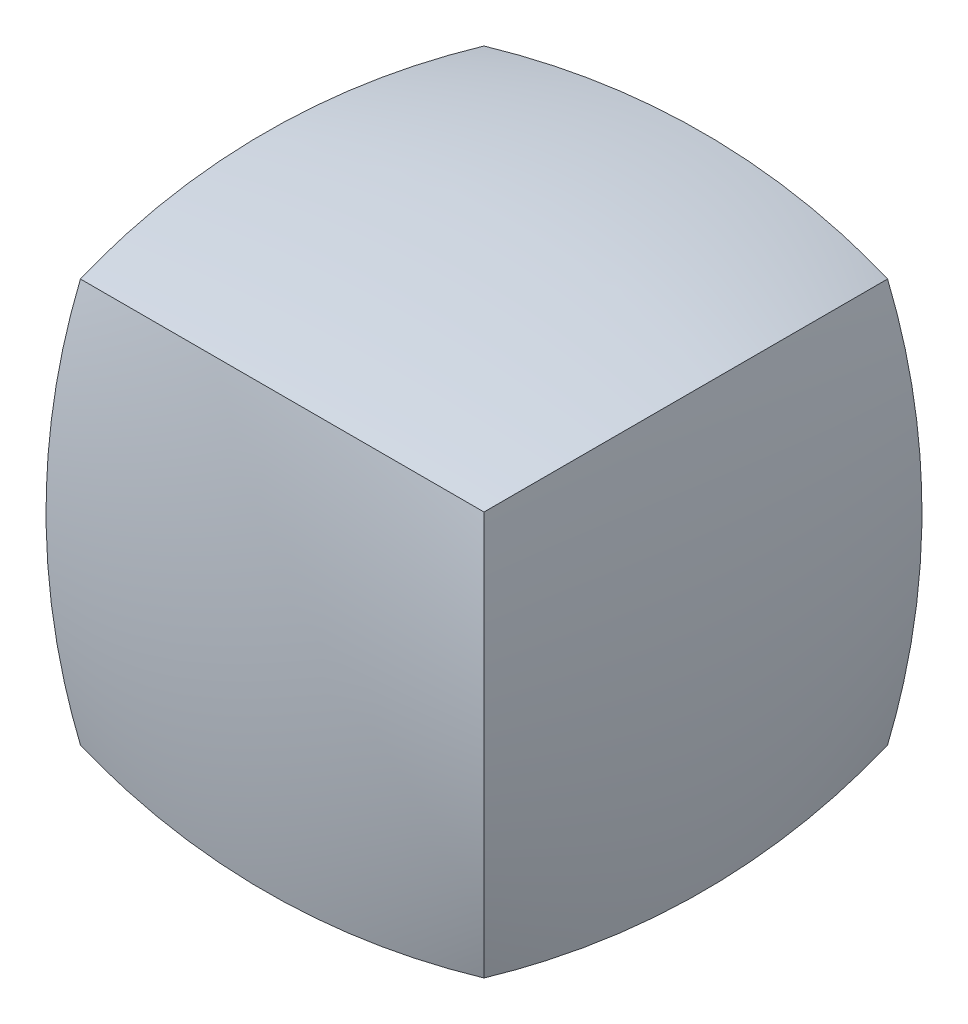
ISO-10303-21;
HEADER;
FILE_DESCRIPTION(('STEP AP214'),'2;1');
FILE_NAME('part.step','',(''),(''),'','','');
FILE_SCHEMA(('AUTOMOTIVE_DESIGN { 1 0 10303 214 1 1 1 1 }'));
ENDSEC;
DATA;
#1=APPLICATION_CONTEXT('core data for automotive mechanical design processes');
#2=APPLICATION_PROTOCOL_DEFINITION('international standard','automotive_design',2000,#1);
#3=PRODUCT_CONTEXT('',#1,'mechanical');
#4=PRODUCT('Part','Part','',(#3));
#5=PRODUCT_RELATED_PRODUCT_CATEGORY('part','',(#4));
#6=PRODUCT_DEFINITION_FORMATION('','',#4);
#7=PRODUCT_DEFINITION_CONTEXT('part definition',#1,'design');
#8=PRODUCT_DEFINITION('design','',#6,#7);
#9=PRODUCT_DEFINITION_SHAPE('','',#8);
#10=(LENGTH_UNIT() NAMED_UNIT(*) SI_UNIT(.MILLI.,.METRE.));
#11=(NAMED_UNIT(*) PLANE_ANGLE_UNIT() SI_UNIT($,.RADIAN.));
#12=(NAMED_UNIT(*) SI_UNIT($,.STERADIAN.) SOLID_ANGLE_UNIT());
#13=UNCERTAINTY_MEASURE_WITH_UNIT(LENGTH_MEASURE(1.E-05),#10,'distance_accuracy_value','');
#14=(GEOMETRIC_REPRESENTATION_CONTEXT(3) GLOBAL_UNCERTAINTY_ASSIGNED_CONTEXT((#13)) GLOBAL_UNIT_ASSIGNED_CONTEXT((#10,
#11,#12)) REPRESENTATION_CONTEXT('',''));
#15=CARTESIAN_POINT('',(0.,0.,0.));
#16=DIRECTION('',(0.,0.,1.));
#17=DIRECTION('',(1.,0.,0.));
#18=AXIS2_PLACEMENT_3D('',#15,#16,#17);
#19=CARTESIAN_POINT('',(-12.6999999999999,-12.6999999999999,-12.7000000000001));
#20=CARTESIAN_POINT('',(-4.29501009499707,-14.1440994317725,-14.1440994317726));
#21=CARTESIAN_POINT('',(4.2950100949973,-14.1440994317725,-14.1440994317725));
#22=CARTESIAN_POINT('',(12.7000000000001,-12.7,-12.7));
#23=CARTESIAN_POINT('',(-14.1440994317725,-14.1440994317725,-4.29501009499725));
#24=CARTESIAN_POINT('',(-4.77637657225462,-15.588198863545,-4.77637657225471));
#25=CARTESIAN_POINT('',(4.77637657225472,-15.5881988635449,-4.77637657225467));
#26=CARTESIAN_POINT('',(14.1440994317726,-14.1440994317725,-4.29501009499718));
#27=CARTESIAN_POINT('',(-14.1440994317725,-14.1440994317725,4.29501009499709));
#28=CARTESIAN_POINT('',(-4.77637657225466,-15.588198863545,4.77637657225468));
#29=CARTESIAN_POINT('',(4.77637657225466,-15.5881988635449,4.77637657225468));
#30=CARTESIAN_POINT('',(14.1440994317726,-14.1440994317726,4.29501009499718));
#31=CARTESIAN_POINT('',(-12.7000000000001,-12.7000000000001,12.6999999999999));
#32=CARTESIAN_POINT('',(-4.29501009499723,-14.1440994317725,14.1440994317726));
#33=CARTESIAN_POINT('',(4.2950100949971,-14.1440994317725,14.1440994317725));
#34=CARTESIAN_POINT('',(12.7000000000002,-12.7000000000002,12.7));
#35=B_SPLINE_SURFACE_WITH_KNOTS('',3,3,((#19,#20,#21,#22),(#23,#24,#25,#26),(#27,#28,#29,#30),
(#31,#32,#33,#34)),.UNSPECIFIED.,.F.,.F.,.F.,(4,4),(4,4),(0.,1.),(0.,1.),.UNSPECIFIED.);
#36=CARTESIAN_POINT('',(-12.7,-12.7000000000001,12.7));
#37=CARTESIAN_POINT('',(-14.1440994317725,-14.1440994317725,4.29501009499724));
#38=CARTESIAN_POINT('',(-14.1440994317726,-14.1440994317725,-4.29501009499709));
#39=CARTESIAN_POINT('',(-12.7000000000002,-12.7,-12.6999999999999));
#40=B_SPLINE_CURVE_WITH_KNOTS('',3,(#36,#37,#38,#39),.UNSPECIFIED.,.F.,.F.,(4,4),(0.,1.),.UNSPECIFIED.);
#41=CARTESIAN_POINT('',(-12.7,-12.7,-12.7));
#42=VERTEX_POINT('',#41);
#43=CARTESIAN_POINT('',(-12.7,-12.7000000000001,12.7));
#44=VERTEX_POINT('',#43);
#45=EDGE_CURVE('E114',#42,#44,#40,.F.);
#46=CARTESIAN_POINT('',(-12.7,-12.7000000000001,-12.7));
#47=CARTESIAN_POINT('',(-4.29501009499719,-14.1440994317725,-14.1440994317725));
#48=CARTESIAN_POINT('',(4.29501009499714,-14.1440994317725,-14.1440994317725));
#49=CARTESIAN_POINT('',(12.6999999999999,-12.7,-12.7000000000001));
#50=B_SPLINE_CURVE_WITH_KNOTS('',3,(#46,#47,#48,#49),.UNSPECIFIED.,.F.,.F.,(4,4),(0.,1.),.UNSPECIFIED.);
#51=CARTESIAN_POINT('',(12.7,-12.7000000000001,-12.7000000000001));
#52=VERTEX_POINT('',#51);
#53=EDGE_CURVE('E73',#52,#42,#50,.F.);
#54=CARTESIAN_POINT('',(12.7000000000001,-12.7000000000001,-12.6999999999999));
#55=CARTESIAN_POINT('',(14.1440994317725,-14.1440994317725,-4.29501009499714));
#56=CARTESIAN_POINT('',(14.1440994317725,-14.1440994317725,4.29501009499718));
#57=CARTESIAN_POINT('',(12.7000000000001,-12.7,12.7));
#58=B_SPLINE_CURVE_WITH_KNOTS('',3,(#54,#55,#56,#57),.UNSPECIFIED.,.F.,.F.,(4,4),(0.,1.),.UNSPECIFIED.);
#59=CARTESIAN_POINT('',(12.7000000000001,-12.7000000000001,12.7));
#60=VERTEX_POINT('',#59);
#61=EDGE_CURVE('E110',#60,#52,#58,.F.);
#62=CARTESIAN_POINT('',(12.6999999999999,-12.7000000000001,12.7000000000001));
#63=CARTESIAN_POINT('',(4.29501009499709,-14.1440994317725,14.1440994317725));
#64=CARTESIAN_POINT('',(-4.29501009499723,-14.1440994317725,14.1440994317725));
#65=CARTESIAN_POINT('',(-12.7,-12.7,12.7000000000001));
#66=B_SPLINE_CURVE_WITH_KNOTS('',3,(#62,#63,#64,#65),.UNSPECIFIED.,.F.,.F.,(4,4),(0.,1.),.UNSPECIFIED.);
#67=EDGE_CURVE('E132',#44,#60,#66,.F.);
#68=ORIENTED_EDGE('',*,*,#45,.F.);
#69=ORIENTED_EDGE('',*,*,#53,.F.);
#70=ORIENTED_EDGE('',*,*,#61,.F.);
#71=ORIENTED_EDGE('',*,*,#67,.F.);
#72=EDGE_LOOP('',(#68,#69,#70,#71));
#73=FACE_BOUND('',#72,.T.);
#74=ADVANCED_FACE('F68',(#73),#35,.F.);
#75=CARTESIAN_POINT('',(-12.7,12.7,-12.6999999999999));
#76=CARTESIAN_POINT('',(-14.1440994317724,4.29501009499727,-14.1440994317724));
#77=CARTESIAN_POINT('',(-14.1440994317725,-4.29501009499709,-14.1440994317724));
#78=CARTESIAN_POINT('',(-12.7,-12.7000000000001,-12.7));
#79=CARTESIAN_POINT('',(-4.2950100949972,14.1440994317725,-14.1440994317725));
#80=CARTESIAN_POINT('',(-4.77637657225469,4.77637657225475,-15.5881988635449));
#81=CARTESIAN_POINT('',(-4.7763765722547,-4.77637657225456,-15.5881988635449));
#82=CARTESIAN_POINT('',(-4.29501009499719,-14.1440994317725,-14.1440994317725));
#83=CARTESIAN_POINT('',(4.29501009499713,14.1440994317725,-14.1440994317726));
#84=CARTESIAN_POINT('',(4.7763765722546,4.77637657225476,-15.5881988635449));
#85=CARTESIAN_POINT('',(4.77637657225462,-4.77637657225454,-15.5881988635449));
#86=CARTESIAN_POINT('',(4.29501009499714,-14.1440994317725,-14.1440994317725));
#87=CARTESIAN_POINT('',(12.6999999999999,12.7000000000001,-12.7000000000002));
#88=CARTESIAN_POINT('',(14.1440994317724,4.29501009499727,-14.1440994317724));
#89=CARTESIAN_POINT('',(14.1440994317724,-4.29501009499706,-14.1440994317725));
#90=CARTESIAN_POINT('',(12.6999999999999,-12.7,-12.7000000000001));
#91=B_SPLINE_SURFACE_WITH_KNOTS('',3,3,((#75,#76,#77,#78),(#79,#80,#81,#82),(#83,#84,#85,#86),
(#87,#88,#89,#90)),.UNSPECIFIED.,.F.,.F.,.F.,(4,4),(4,4),(0.,1.),(0.,1.),.UNSPECIFIED.);
#92=CARTESIAN_POINT('',(-12.6999999999999,12.6999999999999,-12.7000000000001));
#93=CARTESIAN_POINT('',(-4.29501009499707,14.1440994317725,-14.1440994317726));
#94=CARTESIAN_POINT('',(4.2950100949973,14.1440994317725,-14.1440994317725));
#95=CARTESIAN_POINT('',(12.7000000000001,12.7,-12.7));
#96=B_SPLINE_CURVE_WITH_KNOTS('',3,(#92,#93,#94,#95),.UNSPECIFIED.,.F.,.F.,(4,4),(0.,1.),.UNSPECIFIED.);
#97=CARTESIAN_POINT('',(12.7,12.7000000000001,-12.7000000000001));
#98=VERTEX_POINT('',#97);
#99=CARTESIAN_POINT('',(-12.7,12.7,-12.7));
#100=VERTEX_POINT('',#99);
#101=EDGE_CURVE('E91',#98,#100,#96,.F.);
#102=CARTESIAN_POINT('',(12.7,12.7,-12.7));
#103=CARTESIAN_POINT('',(14.1440994317725,4.29501009499727,-14.1440994317724));
#104=CARTESIAN_POINT('',(14.1440994317725,-4.29501009499709,-14.1440994317724));
#105=CARTESIAN_POINT('',(12.7000000000001,-12.7000000000001,-12.6999999999999));
#106=B_SPLINE_CURVE_WITH_KNOTS('',3,(#102,#103,#104,#105),.UNSPECIFIED.,.F.,.F.,(4,4),(0.,1.),.UNSPECIFIED.);
#107=EDGE_CURVE('E117',#52,#98,#106,.F.);
#108=CARTESIAN_POINT('',(-12.7000000000003,12.7000000000001,-12.6999999999999));
#109=CARTESIAN_POINT('',(-14.1440994317725,4.29501009499727,-14.1440994317723));
#110=CARTESIAN_POINT('',(-14.1440994317726,-4.29501009499706,-14.1440994317724));
#111=CARTESIAN_POINT('',(-12.7000000000002,-12.7,-12.6999999999999));
#112=B_SPLINE_CURVE_WITH_KNOTS('',3,(#108,#109,#110,#111),.UNSPECIFIED.,.F.,.F.,(4,4),(0.,1.),.UNSPECIFIED.);
#113=EDGE_CURVE('E170',#100,#42,#112,.T.);
#114=ORIENTED_EDGE('',*,*,#101,.F.);
#115=ORIENTED_EDGE('',*,*,#107,.F.);
#116=ORIENTED_EDGE('',*,*,#53,.T.);
#117=ORIENTED_EDGE('',*,*,#113,.F.);
#118=EDGE_LOOP('',(#114,#115,#116,#117));
#119=FACE_BOUND('',#118,.T.);
#120=ADVANCED_FACE('F118',(#119),#91,.T.);
#121=CARTESIAN_POINT('',(12.7,12.7,-12.7));
#122=CARTESIAN_POINT('',(14.1440994317725,4.29501009499727,-14.1440994317724));
#123=CARTESIAN_POINT('',(14.1440994317725,-4.29501009499709,-14.1440994317724));
#124=CARTESIAN_POINT('',(12.7000000000001,-12.7000000000001,-12.6999999999999));
#125=CARTESIAN_POINT('',(14.1440994317725,14.1440994317725,-4.29501009499715));
#126=CARTESIAN_POINT('',(15.5881988635449,4.77637657225475,-4.77637657225464));
#127=CARTESIAN_POINT('',(15.5881988635449,-4.77637657225456,-4.77637657225464));
#128=CARTESIAN_POINT('',(14.1440994317725,-14.1440994317725,-4.29501009499714));
#129=CARTESIAN_POINT('',(14.1440994317726,14.1440994317725,4.29501009499718));
#130=CARTESIAN_POINT('',(15.5881988635449,4.77637657225476,4.77637657225465));
#131=CARTESIAN_POINT('',(15.5881988635449,-4.77637657225454,4.77637657225468));
#132=CARTESIAN_POINT('',(14.1440994317725,-14.1440994317725,4.29501009499718));
#133=CARTESIAN_POINT('',(12.7000000000002,12.7000000000001,12.7));
#134=CARTESIAN_POINT('',(14.1440994317724,4.29501009499727,14.1440994317724));
#135=CARTESIAN_POINT('',(14.1440994317725,-4.29501009499706,14.1440994317725));
#136=CARTESIAN_POINT('',(12.7000000000001,-12.7,12.7));
#137=B_SPLINE_SURFACE_WITH_KNOTS('',3,3,((#121,#122,#123,#124),(#125,#126,#127,#128),(#129,#130,
#131,#132),(#133,#134,#135,#136)),.UNSPECIFIED.,.F.,.F.,.F.,(4,4),(4,4),(0.,1.),(0.,1.),.UNSPECIFIED.);
#138=CARTESIAN_POINT('',(12.7000000000001,12.7,-12.7));
#139=CARTESIAN_POINT('',(14.1440994317726,14.1440994317725,-4.29501009499718));
#140=CARTESIAN_POINT('',(14.1440994317726,14.1440994317726,4.29501009499718));
#141=CARTESIAN_POINT('',(12.7000000000002,12.7000000000002,12.7));
#142=B_SPLINE_CURVE_WITH_KNOTS('',3,(#138,#139,#140,#141),.UNSPECIFIED.,.F.,.F.,(4,4),(0.,1.),.UNSPECIFIED.);
#143=CARTESIAN_POINT('',(12.7000000000001,12.7000000000001,12.7));
#144=VERTEX_POINT('',#143);
#145=EDGE_CURVE('E185',#144,#98,#142,.F.);
#146=CARTESIAN_POINT('',(12.6999999999999,12.7,12.7));
#147=CARTESIAN_POINT('',(14.1440994317723,4.29501009499727,14.1440994317725));
#148=CARTESIAN_POINT('',(14.1440994317724,-4.29501009499709,14.1440994317725));
#149=CARTESIAN_POINT('',(12.6999999999999,-12.7000000000001,12.7000000000001));
#150=B_SPLINE_CURVE_WITH_KNOTS('',3,(#146,#147,#148,#149),.UNSPECIFIED.,.F.,.F.,(4,4),(0.,1.),.UNSPECIFIED.);
#151=EDGE_CURVE('E124',#60,#144,#150,.F.);
#152=ORIENTED_EDGE('',*,*,#145,.F.);
#153=ORIENTED_EDGE('',*,*,#151,.F.);
#154=ORIENTED_EDGE('',*,*,#61,.T.);
#155=ORIENTED_EDGE('',*,*,#107,.T.);
#156=EDGE_LOOP('',(#152,#153,#154,#155));
#157=FACE_BOUND('',#156,.T.);
#158=ADVANCED_FACE('F122',(#157),#137,.T.);
#159=CARTESIAN_POINT('',(12.6999999999999,12.7,12.7));
#160=CARTESIAN_POINT('',(14.1440994317723,4.29501009499727,14.1440994317725));
#161=CARTESIAN_POINT('',(14.1440994317724,-4.29501009499709,14.1440994317725));
#162=CARTESIAN_POINT('',(12.6999999999999,-12.7000000000001,12.7000000000001));
#163=CARTESIAN_POINT('',(4.2950100949971,14.1440994317725,14.1440994317725));
#164=CARTESIAN_POINT('',(4.77637657225458,4.77637657225475,15.5881988635449));
#165=CARTESIAN_POINT('',(4.77637657225459,-4.77637657225456,15.5881988635449));
#166=CARTESIAN_POINT('',(4.29501009499709,-14.1440994317725,14.1440994317725));
#167=CARTESIAN_POINT('',(-4.29501009499723,14.1440994317725,14.1440994317726));
#168=CARTESIAN_POINT('',(-4.77637657225471,4.77637657225476,15.5881988635449));
#169=CARTESIAN_POINT('',(-4.77637657225473,-4.77637657225454,15.5881988635449));
#170=CARTESIAN_POINT('',(-4.29501009499723,-14.1440994317725,14.1440994317725));
#171=CARTESIAN_POINT('',(-12.7,12.7000000000001,12.7000000000001));
#172=CARTESIAN_POINT('',(-14.1440994317725,4.29501009499727,14.1440994317723));
#173=CARTESIAN_POINT('',(-14.1440994317725,-4.29501009499706,14.1440994317724));
#174=CARTESIAN_POINT('',(-12.7,-12.7,12.7000000000001));
#175=B_SPLINE_SURFACE_WITH_KNOTS('',3,3,((#159,#160,#161,#162),(#163,#164,#165,#166),(#167,#168,
#169,#170),(#171,#172,#173,#174)),.UNSPECIFIED.,.F.,.F.,.F.,(4,4),(4,4),(0.,1.),(0.,1.),.UNSPECIFIED.);
#176=CARTESIAN_POINT('',(-12.7000000000001,12.7000000000001,12.6999999999999));
#177=CARTESIAN_POINT('',(-4.29501009499723,14.1440994317725,14.1440994317726));
#178=CARTESIAN_POINT('',(4.2950100949971,14.1440994317725,14.1440994317725));
#179=CARTESIAN_POINT('',(12.7000000000002,12.7000000000002,12.7));
#180=B_SPLINE_CURVE_WITH_KNOTS('',3,(#176,#177,#178,#179),.UNSPECIFIED.,.F.,.F.,(4,4),(0.,1.),.UNSPECIFIED.);
#181=CARTESIAN_POINT('',(-12.7,12.7000000000001,12.7000000000001));
#182=VERTEX_POINT('',#181);
#183=EDGE_CURVE('E82',#182,#144,#180,.T.);
#184=CARTESIAN_POINT('',(-12.6999999999999,12.7,12.7));
#185=CARTESIAN_POINT('',(-14.1440994317724,4.29501009499727,14.1440994317725));
#186=CARTESIAN_POINT('',(-14.1440994317724,-4.29501009499709,14.1440994317725));
#187=CARTESIAN_POINT('',(-12.7,-12.7000000000001,12.7));
#188=B_SPLINE_CURVE_WITH_KNOTS('',3,(#184,#185,#186,#187),.UNSPECIFIED.,.F.,.F.,(4,4),(0.,1.),.UNSPECIFIED.);
#189=EDGE_CURVE('E154',#44,#182,#188,.F.);
#190=ORIENTED_EDGE('',*,*,#183,.F.);
#191=ORIENTED_EDGE('',*,*,#189,.F.);
#192=ORIENTED_EDGE('',*,*,#67,.T.);
#193=ORIENTED_EDGE('',*,*,#151,.T.);
#194=EDGE_LOOP('',(#190,#191,#192,#193));
#195=FACE_BOUND('',#194,.T.);
#196=ADVANCED_FACE('F218',(#195),#175,.T.);
#197=CARTESIAN_POINT('',(-12.6999999999999,12.7,12.7));
#198=CARTESIAN_POINT('',(-14.1440994317724,4.29501009499727,14.1440994317725));
#199=CARTESIAN_POINT('',(-14.1440994317724,-4.29501009499709,14.1440994317725));
#200=CARTESIAN_POINT('',(-12.7,-12.7000000000001,12.7));
#201=CARTESIAN_POINT('',(-14.1440994317725,14.1440994317725,4.29501009499725));
#202=CARTESIAN_POINT('',(-15.5881988635448,4.77637657225475,4.77637657225475));
#203=CARTESIAN_POINT('',(-15.5881988635449,-4.77637657225456,4.77637657225475));
#204=CARTESIAN_POINT('',(-14.1440994317725,-14.1440994317725,4.29501009499724));
#205=CARTESIAN_POINT('',(-14.1440994317726,14.1440994317725,-4.29501009499708));
#206=CARTESIAN_POINT('',(-15.5881988635449,4.77637657225476,-4.77637657225454));
#207=CARTESIAN_POINT('',(-15.5881988635449,-4.77637657225454,-4.77637657225457));
#208=CARTESIAN_POINT('',(-14.1440994317726,-14.1440994317725,-4.29501009499709));
#209=CARTESIAN_POINT('',(-12.7000000000003,12.7000000000001,-12.6999999999999));
#210=CARTESIAN_POINT('',(-14.1440994317725,4.29501009499727,-14.1440994317723));
#211=CARTESIAN_POINT('',(-14.1440994317726,-4.29501009499706,-14.1440994317724));
#212=CARTESIAN_POINT('',(-12.7000000000002,-12.7,-12.6999999999999));
#213=B_SPLINE_SURFACE_WITH_KNOTS('',3,3,((#197,#198,#199,#200),(#201,#202,#203,#204),(#205,#206,
#207,#208),(#209,#210,#211,#212)),.UNSPECIFIED.,.F.,.F.,.F.,(4,4),(4,4),(0.,1.),(0.,1.),.UNSPECIFIED.);
#214=CARTESIAN_POINT('',(-12.6999999999999,12.6999999999999,-12.7000000000001));
#215=CARTESIAN_POINT('',(-14.1440994317725,14.1440994317725,-4.29501009499725));
#216=CARTESIAN_POINT('',(-14.1440994317725,14.1440994317725,4.29501009499709));
#217=CARTESIAN_POINT('',(-12.7000000000001,12.7000000000001,12.6999999999999));
#218=B_SPLINE_CURVE_WITH_KNOTS('',3,(#214,#215,#216,#217),.UNSPECIFIED.,.F.,.F.,(4,4),(0.,1.),.UNSPECIFIED.);
#219=EDGE_CURVE('E14',#100,#182,#218,.T.);
#220=ORIENTED_EDGE('',*,*,#219,.F.);
#221=ORIENTED_EDGE('',*,*,#113,.T.);
#222=ORIENTED_EDGE('',*,*,#45,.T.);
#223=ORIENTED_EDGE('',*,*,#189,.T.);
#224=EDGE_LOOP('',(#220,#221,#222,#223));
#225=FACE_BOUND('',#224,.T.);
#226=ADVANCED_FACE('F220',(#225),#213,.T.);
#227=CARTESIAN_POINT('',(-12.6999999999999,12.6999999999999,-12.7000000000001));
#228=CARTESIAN_POINT('',(-4.29501009499707,14.1440994317725,-14.1440994317726));
#229=CARTESIAN_POINT('',(4.2950100949973,14.1440994317725,-14.1440994317725));
#230=CARTESIAN_POINT('',(12.7000000000001,12.7,-12.7));
#231=CARTESIAN_POINT('',(-14.1440994317725,14.1440994317725,-4.29501009499725));
#232=CARTESIAN_POINT('',(-4.77637657225462,15.588198863545,-4.77637657225471));
#233=CARTESIAN_POINT('',(4.77637657225472,15.5881988635449,-4.77637657225467));
#234=CARTESIAN_POINT('',(14.1440994317726,14.1440994317725,-4.29501009499718));
#235=CARTESIAN_POINT('',(-14.1440994317725,14.1440994317725,4.29501009499709));
#236=CARTESIAN_POINT('',(-4.77637657225466,15.588198863545,4.77637657225468));
#237=CARTESIAN_POINT('',(4.77637657225466,15.5881988635449,4.77637657225468));
#238=CARTESIAN_POINT('',(14.1440994317726,14.1440994317726,4.29501009499718));
#239=CARTESIAN_POINT('',(-12.7000000000001,12.7000000000001,12.6999999999999));
#240=CARTESIAN_POINT('',(-4.29501009499723,14.1440994317725,14.1440994317726));
#241=CARTESIAN_POINT('',(4.2950100949971,14.1440994317725,14.1440994317725));
#242=CARTESIAN_POINT('',(12.7000000000002,12.7000000000002,12.7));
#243=B_SPLINE_SURFACE_WITH_KNOTS('',3,3,((#227,#228,#229,#230),(#231,#232,#233,#234),(#235,#236,
#237,#238),(#239,#240,#241,#242)),.UNSPECIFIED.,.F.,.F.,.F.,(4,4),(4,4),(0.,1.),(0.,1.),.UNSPECIFIED.);
#244=ORIENTED_EDGE('',*,*,#219,.T.);
#245=ORIENTED_EDGE('',*,*,#183,.T.);
#246=ORIENTED_EDGE('',*,*,#145,.T.);
#247=ORIENTED_EDGE('',*,*,#101,.T.);
#248=EDGE_LOOP('',(#244,#245,#246,#247));
#249=FACE_BOUND('',#248,.T.);
#250=ADVANCED_FACE('F214',(#249),#243,.T.);
#251=CLOSED_SHELL('',(#74,#120,#158,#196,#226,#250));
#252=MANIFOLD_SOLID_BREP('B2',#251);
#253=ADVANCED_BREP_SHAPE_REPRESENTATION('',(#18,#252),#14);
#254=SHAPE_DEFINITION_REPRESENTATION(#9,#253);
ENDSEC;
END-ISO-10303-21;
